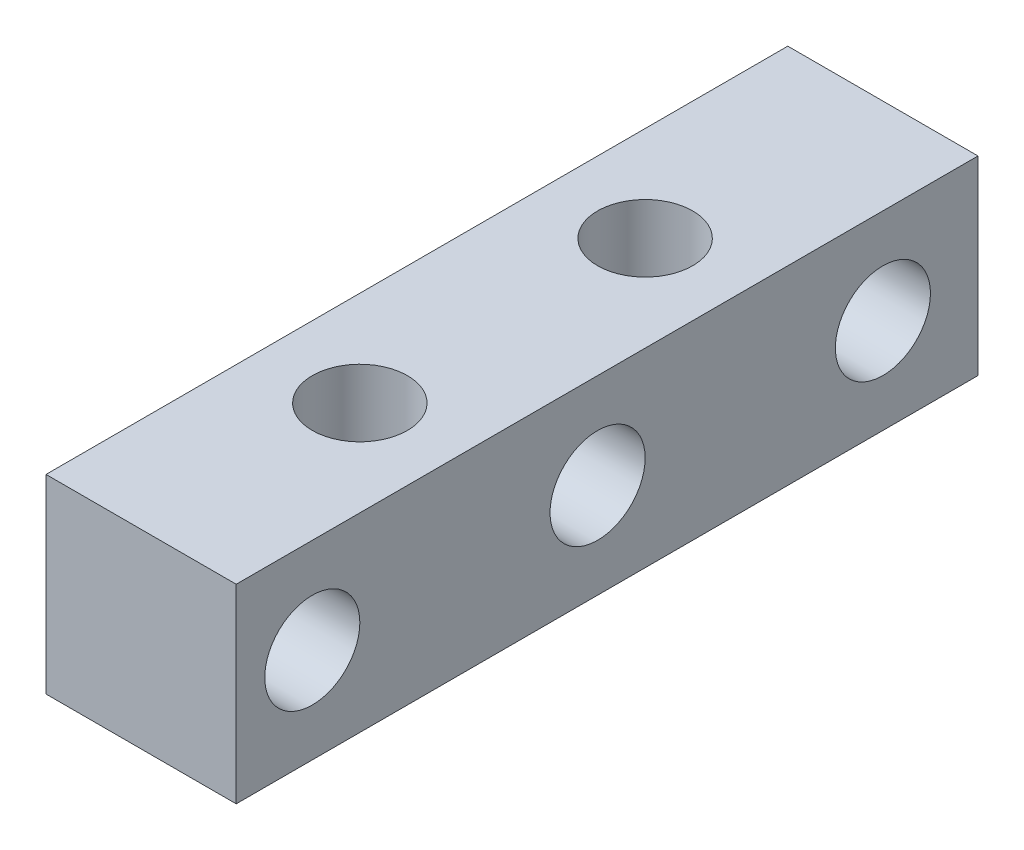
ISO-10303-21;
HEADER;
FILE_DESCRIPTION(('STEP AP214'),'2;1');
FILE_NAME('part.step','',(''),(''),'','','');
FILE_SCHEMA(('AUTOMOTIVE_DESIGN { 1 0 10303 214 1 1 1 1 }'));
ENDSEC;
DATA;
#1=APPLICATION_CONTEXT('core data for automotive mechanical design processes');
#2=APPLICATION_PROTOCOL_DEFINITION('international standard','automotive_design',2000,#1);
#3=PRODUCT_CONTEXT('',#1,'mechanical');
#4=PRODUCT('Part','Part','',(#3));
#5=PRODUCT_RELATED_PRODUCT_CATEGORY('part','',(#4));
#6=PRODUCT_DEFINITION_FORMATION('','',#4);
#7=PRODUCT_DEFINITION_CONTEXT('part definition',#1,'design');
#8=PRODUCT_DEFINITION('design','',#6,#7);
#9=PRODUCT_DEFINITION_SHAPE('','',#8);
#10=(LENGTH_UNIT() NAMED_UNIT(*) SI_UNIT(.MILLI.,.METRE.));
#11=(NAMED_UNIT(*) PLANE_ANGLE_UNIT() SI_UNIT($,.RADIAN.));
#12=(NAMED_UNIT(*) SI_UNIT($,.STERADIAN.) SOLID_ANGLE_UNIT());
#13=UNCERTAINTY_MEASURE_WITH_UNIT(LENGTH_MEASURE(1.E-05),#10,'distance_accuracy_value','');
#14=(GEOMETRIC_REPRESENTATION_CONTEXT(3) GLOBAL_UNCERTAINTY_ASSIGNED_CONTEXT((#13)) GLOBAL_UNIT_ASSIGNED_CONTEXT((#10,
#11,#12)) REPRESENTATION_CONTEXT('',''));
#15=CARTESIAN_POINT('',(0.,0.,0.));
#16=DIRECTION('',(0.,0.,1.));
#17=DIRECTION('',(1.,0.,0.));
#18=AXIS2_PLACEMENT_3D('',#15,#16,#17);
#19=CARTESIAN_POINT('',(-6.35,6.35,34.925));
#20=DIRECTION('',(0.,-1.,0.));
#21=DIRECTION('',(0.,0.,-1.));
#22=AXIS2_PLACEMENT_3D('',#19,#20,#21);
#23=PLANE('',#22);
#24=CARTESIAN_POINT('',(0.,6.35,0.));
#25=DIRECTION('',(0.,1.,0.));
#26=DIRECTION('',(0.,0.,1.));
#27=AXIS2_PLACEMENT_3D('',#24,#25,#26);
#28=CIRCLE('',#27,3.17499999999999);
#29=CARTESIAN_POINT('',(0.,6.35,3.17499999999999));
#30=VERTEX_POINT('',#29);
#31=EDGE_CURVE('E132',#30,#30,#28,.T.);
#32=ORIENTED_EDGE('',*,*,#31,.F.);
#33=EDGE_LOOP('',(#32));
#34=FACE_BOUND('',#33,.T.);
#35=DIRECTION('',(0.,0.,-1.));
#36=VECTOR('',#35,1.);
#37=CARTESIAN_POINT('',(-6.35,6.35,34.925));
#38=LINE('',#37,#36);
#39=CARTESIAN_POINT('',(-6.35,6.35,14.605));
#40=VERTEX_POINT('',#39);
#41=CARTESIAN_POINT('',(-6.35,6.35,-34.925));
#42=VERTEX_POINT('',#41);
#43=EDGE_CURVE('E55',#40,#42,#38,.T.);
#44=ORIENTED_EDGE('',*,*,#43,.F.);
#45=DIRECTION('',(-1.,0.,0.));
#46=VECTOR('',#45,1.);
#47=CARTESIAN_POINT('',(-6.35,6.35,14.605));
#48=LINE('',#47,#46);
#49=CARTESIAN_POINT('',(6.35,6.35,14.605));
#50=VERTEX_POINT('',#49);
#51=EDGE_CURVE('E74',#50,#40,#48,.T.);
#52=ORIENTED_EDGE('',*,*,#51,.F.);
#53=DIRECTION('',(0.,0.,-1.));
#54=VECTOR('',#53,1.);
#55=CARTESIAN_POINT('',(6.35,6.35,34.925));
#56=LINE('',#55,#54);
#57=CARTESIAN_POINT('',(6.35,6.35,-34.925));
#58=VERTEX_POINT('',#57);
#59=EDGE_CURVE('E104',#50,#58,#56,.T.);
#60=ORIENTED_EDGE('',*,*,#59,.T.);
#61=DIRECTION('',(-1.,0.,0.));
#62=VECTOR('',#61,1.);
#63=CARTESIAN_POINT('',(-6.35,6.35,-34.925));
#64=LINE('',#63,#62);
#65=EDGE_CURVE('E101',#58,#42,#64,.T.);
#66=ORIENTED_EDGE('',*,*,#65,.T.);
#67=EDGE_LOOP('',(#44,#52,#60,#66));
#68=FACE_BOUND('',#67,.T.);
#69=CARTESIAN_POINT('',(0.,6.35,-19.05));
#70=DIRECTION('',(0.,1.,0.));
#71=DIRECTION('',(0.,0.,1.));
#72=AXIS2_PLACEMENT_3D('',#69,#70,#71);
#73=CIRCLE('',#72,3.17499999999999);
#74=CARTESIAN_POINT('',(0.,6.35,-15.875));
#75=VERTEX_POINT('',#74);
#76=EDGE_CURVE('E95',#75,#75,#73,.T.);
#77=ORIENTED_EDGE('',*,*,#76,.F.);
#78=EDGE_LOOP('',(#77));
#79=FACE_BOUND('',#78,.T.);
#80=ADVANCED_FACE('F32',(#34,#68,#79),#23,.F.);
#81=CARTESIAN_POINT('',(-6.35,-6.35,34.925));
#82=DIRECTION('',(1.,0.,0.));
#83=DIRECTION('',(0.,0.,-1.));
#84=AXIS2_PLACEMENT_3D('',#81,#82,#83);
#85=PLANE('',#84);
#86=CARTESIAN_POINT('',(-6.35,0.,-9.525));
#87=DIRECTION('',(1.,0.,0.));
#88=DIRECTION('',(0.,0.,-1.));
#89=AXIS2_PLACEMENT_3D('',#86,#87,#88);
#90=CIRCLE('',#89,3.175);
#91=CARTESIAN_POINT('',(-6.35,0.,-12.7));
#92=VERTEX_POINT('',#91);
#93=EDGE_CURVE('E117',#92,#92,#90,.T.);
#94=ORIENTED_EDGE('',*,*,#93,.T.);
#95=EDGE_LOOP('',(#94));
#96=FACE_BOUND('',#95,.T.);
#97=CARTESIAN_POINT('',(-6.35,0.,-28.575));
#98=DIRECTION('',(1.,0.,0.));
#99=DIRECTION('',(0.,0.,-1.));
#100=AXIS2_PLACEMENT_3D('',#97,#98,#99);
#101=CIRCLE('',#100,3.175);
#102=CARTESIAN_POINT('',(-6.35,0.,-31.75));
#103=VERTEX_POINT('',#102);
#104=EDGE_CURVE('E123',#103,#103,#101,.T.);
#105=ORIENTED_EDGE('',*,*,#104,.T.);
#106=EDGE_LOOP('',(#105));
#107=FACE_BOUND('',#106,.T.);
#108=CARTESIAN_POINT('',(-6.35,0.,9.525));
#109=DIRECTION('',(1.,0.,0.));
#110=DIRECTION('',(0.,0.,-1.));
#111=AXIS2_PLACEMENT_3D('',#108,#109,#110);
#112=CIRCLE('',#111,3.175);
#113=CARTESIAN_POINT('',(-6.35,0.,6.35000000000001));
#114=VERTEX_POINT('',#113);
#115=EDGE_CURVE('E129',#114,#114,#112,.T.);
#116=ORIENTED_EDGE('',*,*,#115,.T.);
#117=EDGE_LOOP('',(#116));
#118=FACE_BOUND('',#117,.T.);
#119=DIRECTION('',(0.,0.,-1.));
#120=VECTOR('',#119,1.);
#121=CARTESIAN_POINT('',(-6.35,-6.35,34.925));
#122=LINE('',#121,#120);
#123=CARTESIAN_POINT('',(-6.35,-6.35,14.605));
#124=VERTEX_POINT('',#123);
#125=CARTESIAN_POINT('',(-6.35,-6.35,-34.925));
#126=VERTEX_POINT('',#125);
#127=EDGE_CURVE('E11',#124,#126,#122,.T.);
#128=ORIENTED_EDGE('',*,*,#127,.F.);
#129=DIRECTION('',(0.,1.,0.));
#130=VECTOR('',#129,1.);
#131=CARTESIAN_POINT('',(-6.35,-6.35,14.605));
#132=LINE('',#131,#130);
#133=EDGE_CURVE('E71',#124,#40,#132,.T.);
#134=ORIENTED_EDGE('',*,*,#133,.T.);
#135=ORIENTED_EDGE('',*,*,#43,.T.);
#136=DIRECTION('',(0.,-1.,0.));
#137=VECTOR('',#136,1.);
#138=CARTESIAN_POINT('',(-6.35,-6.35,-34.925));
#139=LINE('',#138,#137);
#140=EDGE_CURVE('E86',#42,#126,#139,.T.);
#141=ORIENTED_EDGE('',*,*,#140,.T.);
#142=EDGE_LOOP('',(#128,#134,#135,#141));
#143=FACE_BOUND('',#142,.T.);
#144=ADVANCED_FACE('F34',(#96,#107,#118,#143),#85,.F.);
#145=CARTESIAN_POINT('',(-6.35,-6.35,34.925));
#146=DIRECTION('',(0.,1.,0.));
#147=DIRECTION('',(0.,0.,1.));
#148=AXIS2_PLACEMENT_3D('',#145,#146,#147);
#149=PLANE('',#148);
#150=CARTESIAN_POINT('',(0.,-6.35,0.));
#151=DIRECTION('',(0.,1.,0.));
#152=DIRECTION('',(0.,0.,1.));
#153=AXIS2_PLACEMENT_3D('',#150,#151,#152);
#154=CIRCLE('',#153,3.175);
#155=CARTESIAN_POINT('',(0.,-6.35,3.175));
#156=VERTEX_POINT('',#155);
#157=EDGE_CURVE('E135',#156,#156,#154,.T.);
#158=ORIENTED_EDGE('',*,*,#157,.T.);
#159=EDGE_LOOP('',(#158));
#160=FACE_BOUND('',#159,.T.);
#161=CARTESIAN_POINT('',(0.,-6.35,-19.05));
#162=DIRECTION('',(0.,1.,0.));
#163=DIRECTION('',(0.,0.,1.));
#164=AXIS2_PLACEMENT_3D('',#161,#162,#163);
#165=CIRCLE('',#164,3.175);
#166=CARTESIAN_POINT('',(0.,-6.35,-15.875));
#167=VERTEX_POINT('',#166);
#168=EDGE_CURVE('E90',#167,#167,#165,.T.);
#169=ORIENTED_EDGE('',*,*,#168,.T.);
#170=EDGE_LOOP('',(#169));
#171=FACE_BOUND('',#170,.T.);
#172=DIRECTION('',(0.,0.,-1.));
#173=VECTOR('',#172,1.);
#174=CARTESIAN_POINT('',(6.35,-6.35,34.925));
#175=LINE('',#174,#173);
#176=CARTESIAN_POINT('',(6.35,-6.35,14.605));
#177=VERTEX_POINT('',#176);
#178=CARTESIAN_POINT('',(6.35,-6.35,-34.925));
#179=VERTEX_POINT('',#178);
#180=EDGE_CURVE('E40',#177,#179,#175,.T.);
#181=ORIENTED_EDGE('',*,*,#180,.F.);
#182=DIRECTION('',(-1.,0.,0.));
#183=VECTOR('',#182,1.);
#184=CARTESIAN_POINT('',(-6.35,-6.35,14.605));
#185=LINE('',#184,#183);
#186=EDGE_CURVE('E47',#177,#124,#185,.T.);
#187=ORIENTED_EDGE('',*,*,#186,.T.);
#188=ORIENTED_EDGE('',*,*,#127,.T.);
#189=DIRECTION('',(1.,0.,0.));
#190=VECTOR('',#189,1.);
#191=CARTESIAN_POINT('',(-6.35,-6.35,-34.925));
#192=LINE('',#191,#190);
#193=EDGE_CURVE('E89',#126,#179,#192,.T.);
#194=ORIENTED_EDGE('',*,*,#193,.T.);
#195=EDGE_LOOP('',(#181,#187,#188,#194));
#196=FACE_BOUND('',#195,.T.);
#197=ADVANCED_FACE('F81',(#160,#171,#196),#149,.F.);
#198=CARTESIAN_POINT('',(6.35,-6.35,34.925));
#199=DIRECTION('',(-1.,0.,0.));
#200=DIRECTION('',(0.,0.,1.));
#201=AXIS2_PLACEMENT_3D('',#198,#199,#200);
#202=PLANE('',#201);
#203=CARTESIAN_POINT('',(6.35,0.,-9.525));
#204=DIRECTION('',(1.,0.,0.));
#205=DIRECTION('',(0.,0.,-1.));
#206=AXIS2_PLACEMENT_3D('',#203,#204,#205);
#207=CIRCLE('',#206,3.17499999999999);
#208=CARTESIAN_POINT('',(6.35,0.,-12.7));
#209=VERTEX_POINT('',#208);
#210=EDGE_CURVE('E76',#209,#209,#207,.T.);
#211=ORIENTED_EDGE('',*,*,#210,.F.);
#212=EDGE_LOOP('',(#211));
#213=FACE_BOUND('',#212,.T.);
#214=CARTESIAN_POINT('',(6.35,0.,-28.575));
#215=DIRECTION('',(1.,0.,0.));
#216=DIRECTION('',(0.,0.,-1.));
#217=AXIS2_PLACEMENT_3D('',#214,#215,#216);
#218=CIRCLE('',#217,3.17499999999999);
#219=CARTESIAN_POINT('',(6.35,0.,-31.75));
#220=VERTEX_POINT('',#219);
#221=EDGE_CURVE('E120',#220,#220,#218,.T.);
#222=ORIENTED_EDGE('',*,*,#221,.F.);
#223=EDGE_LOOP('',(#222));
#224=FACE_BOUND('',#223,.T.);
#225=CARTESIAN_POINT('',(6.35,0.,9.525));
#226=DIRECTION('',(1.,0.,0.));
#227=DIRECTION('',(0.,0.,-1.));
#228=AXIS2_PLACEMENT_3D('',#225,#226,#227);
#229=CIRCLE('',#228,3.17499999999999);
#230=CARTESIAN_POINT('',(6.35,0.,6.35000000000002));
#231=VERTEX_POINT('',#230);
#232=EDGE_CURVE('E126',#231,#231,#229,.T.);
#233=ORIENTED_EDGE('',*,*,#232,.F.);
#234=EDGE_LOOP('',(#233));
#235=FACE_BOUND('',#234,.T.);
#236=ORIENTED_EDGE('',*,*,#59,.F.);
#237=DIRECTION('',(0.,1.,0.));
#238=VECTOR('',#237,1.);
#239=CARTESIAN_POINT('',(6.35,-6.35,14.605));
#240=LINE('',#239,#238);
#241=EDGE_CURVE('E77',#177,#50,#240,.T.);
#242=ORIENTED_EDGE('',*,*,#241,.F.);
#243=ORIENTED_EDGE('',*,*,#180,.T.);
#244=DIRECTION('',(0.,1.,0.));
#245=VECTOR('',#244,1.);
#246=CARTESIAN_POINT('',(6.35,-6.35,-34.925));
#247=LINE('',#246,#245);
#248=EDGE_CURVE('E92',#179,#58,#247,.T.);
#249=ORIENTED_EDGE('',*,*,#248,.T.);
#250=EDGE_LOOP('',(#236,#242,#243,#249));
#251=FACE_BOUND('',#250,.T.);
#252=ADVANCED_FACE('F107',(#213,#224,#235,#251),#202,.F.);
#253=CARTESIAN_POINT('',(0.,0.,-34.925));
#254=DIRECTION('',(0.,0.,-1.));
#255=DIRECTION('',(-1.,0.,0.));
#256=AXIS2_PLACEMENT_3D('',#253,#254,#255);
#257=PLANE('',#256);
#258=ORIENTED_EDGE('',*,*,#140,.F.);
#259=ORIENTED_EDGE('',*,*,#65,.F.);
#260=ORIENTED_EDGE('',*,*,#248,.F.);
#261=ORIENTED_EDGE('',*,*,#193,.F.);
#262=EDGE_LOOP('',(#258,#259,#260,#261));
#263=FACE_BOUND('',#262,.T.);
#264=ADVANCED_FACE('F109',(#263),#257,.T.);
#265=CARTESIAN_POINT('',(0.,6.35,-19.05));
#266=DIRECTION('',(0.,1.,0.));
#267=DIRECTION('',(0.,0.,1.));
#268=AXIS2_PLACEMENT_3D('',#265,#266,#267);
#269=CYLINDRICAL_SURFACE('',#268,3.17499999999999);
#270=ORIENTED_EDGE('',*,*,#168,.F.);
#271=EDGE_LOOP('',(#270));
#272=FACE_BOUND('',#271,.T.);
#273=ORIENTED_EDGE('',*,*,#76,.T.);
#274=EDGE_LOOP('',(#273));
#275=FACE_BOUND('',#274,.T.);
#276=ADVANCED_FACE('F140',(#272,#275),#269,.F.);
#277=CARTESIAN_POINT('',(0.,6.35,0.));
#278=DIRECTION('',(0.,1.,0.));
#279=DIRECTION('',(0.,0.,1.));
#280=AXIS2_PLACEMENT_3D('',#277,#278,#279);
#281=CYLINDRICAL_SURFACE('',#280,3.17499999999999);
#282=ORIENTED_EDGE('',*,*,#157,.F.);
#283=EDGE_LOOP('',(#282));
#284=FACE_BOUND('',#283,.T.);
#285=ORIENTED_EDGE('',*,*,#31,.T.);
#286=EDGE_LOOP('',(#285));
#287=FACE_BOUND('',#286,.T.);
#288=ADVANCED_FACE('F163',(#284,#287),#281,.F.);
#289=CARTESIAN_POINT('',(6.35,0.,9.525));
#290=DIRECTION('',(1.,0.,0.));
#291=DIRECTION('',(0.,0.,-1.));
#292=AXIS2_PLACEMENT_3D('',#289,#290,#291);
#293=CYLINDRICAL_SURFACE('',#292,3.17499999999999);
#294=ORIENTED_EDGE('',*,*,#115,.F.);
#295=EDGE_LOOP('',(#294));
#296=FACE_BOUND('',#295,.T.);
#297=ORIENTED_EDGE('',*,*,#232,.T.);
#298=EDGE_LOOP('',(#297));
#299=FACE_BOUND('',#298,.T.);
#300=ADVANCED_FACE('F168',(#296,#299),#293,.F.);
#301=CARTESIAN_POINT('',(6.35,0.,-28.575));
#302=DIRECTION('',(1.,0.,0.));
#303=DIRECTION('',(0.,0.,-1.));
#304=AXIS2_PLACEMENT_3D('',#301,#302,#303);
#305=CYLINDRICAL_SURFACE('',#304,3.17499999999999);
#306=ORIENTED_EDGE('',*,*,#104,.F.);
#307=EDGE_LOOP('',(#306));
#308=FACE_BOUND('',#307,.T.);
#309=ORIENTED_EDGE('',*,*,#221,.T.);
#310=EDGE_LOOP('',(#309));
#311=FACE_BOUND('',#310,.T.);
#312=ADVANCED_FACE('F174',(#308,#311),#305,.F.);
#313=CARTESIAN_POINT('',(6.35,0.,-9.525));
#314=DIRECTION('',(1.,0.,0.));
#315=DIRECTION('',(0.,0.,-1.));
#316=AXIS2_PLACEMENT_3D('',#313,#314,#315);
#317=CYLINDRICAL_SURFACE('',#316,3.17499999999999);
#318=ORIENTED_EDGE('',*,*,#93,.F.);
#319=EDGE_LOOP('',(#318));
#320=FACE_BOUND('',#319,.T.);
#321=ORIENTED_EDGE('',*,*,#210,.T.);
#322=EDGE_LOOP('',(#321));
#323=FACE_BOUND('',#322,.T.);
#324=ADVANCED_FACE('F178',(#320,#323),#317,.F.);
#325=CARTESIAN_POINT('',(-6.35,-6.35,14.605));
#326=DIRECTION('',(0.,0.,-1.));
#327=DIRECTION('',(-1.,0.,0.));
#328=AXIS2_PLACEMENT_3D('',#325,#326,#327);
#329=PLANE('',#328);
#330=ORIENTED_EDGE('',*,*,#51,.T.);
#331=ORIENTED_EDGE('',*,*,#133,.F.);
#332=ORIENTED_EDGE('',*,*,#186,.F.);
#333=ORIENTED_EDGE('',*,*,#241,.T.);
#334=EDGE_LOOP('',(#330,#331,#332,#333));
#335=FACE_BOUND('',#334,.T.);
#336=ADVANCED_FACE('F72',(#335),#329,.F.);
#337=CLOSED_SHELL('',(#80,#144,#197,#252,#264,#276,#288,#300,#312,#324,#336));
#338=MANIFOLD_SOLID_BREP('B2',#337);
#339=ADVANCED_BREP_SHAPE_REPRESENTATION('',(#18,#338),#14);
#340=SHAPE_DEFINITION_REPRESENTATION(#9,#339);
ENDSEC;
END-ISO-10303-21;
